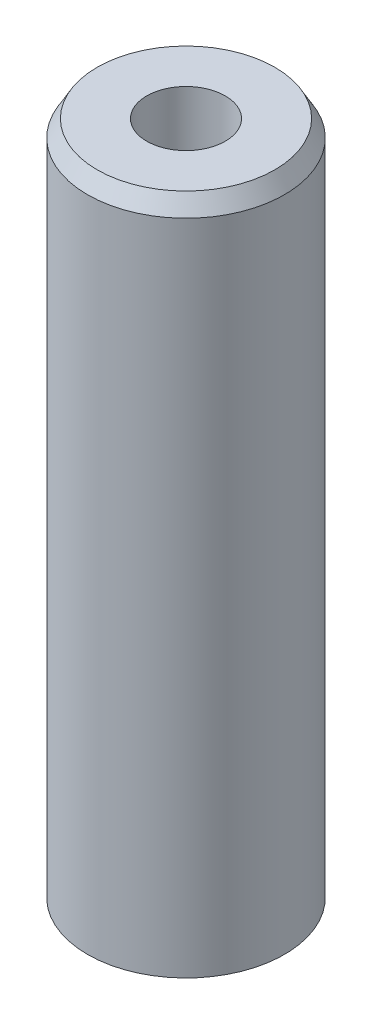
ISO-10303-21;
HEADER;
FILE_DESCRIPTION(('STEP AP214'),'2;1');
FILE_NAME('part.step','',(''),(''),'','','');
FILE_SCHEMA(('AUTOMOTIVE_DESIGN { 1 0 10303 214 1 1 1 1 }'));
ENDSEC;
DATA;
#1=APPLICATION_CONTEXT('core data for automotive mechanical design processes');
#2=APPLICATION_PROTOCOL_DEFINITION('international standard','automotive_design',2000,#1);
#3=PRODUCT_CONTEXT('',#1,'mechanical');
#4=PRODUCT('Part','Part','',(#3));
#5=PRODUCT_RELATED_PRODUCT_CATEGORY('part','',(#4));
#6=PRODUCT_DEFINITION_FORMATION('','',#4);
#7=PRODUCT_DEFINITION_CONTEXT('part definition',#1,'design');
#8=PRODUCT_DEFINITION('design','',#6,#7);
#9=PRODUCT_DEFINITION_SHAPE('','',#8);
#10=(LENGTH_UNIT() NAMED_UNIT(*) SI_UNIT(.MILLI.,.METRE.));
#11=(NAMED_UNIT(*) PLANE_ANGLE_UNIT() SI_UNIT($,.RADIAN.));
#12=(NAMED_UNIT(*) SI_UNIT($,.STERADIAN.) SOLID_ANGLE_UNIT());
#13=UNCERTAINTY_MEASURE_WITH_UNIT(LENGTH_MEASURE(1.E-05),#10,'distance_accuracy_value','');
#14=(GEOMETRIC_REPRESENTATION_CONTEXT(3) GLOBAL_UNCERTAINTY_ASSIGNED_CONTEXT((#13)) GLOBAL_UNIT_ASSIGNED_CONTEXT((#10,
#11,#12)) REPRESENTATION_CONTEXT('',''));
#15=CARTESIAN_POINT('',(0.,0.,0.));
#16=DIRECTION('',(0.,0.,1.));
#17=DIRECTION('',(1.,0.,0.));
#18=AXIS2_PLACEMENT_3D('',#15,#16,#17);
#19=CARTESIAN_POINT('',(0.,243.176926840896,0.));
#20=DIRECTION('',(0.,-1.,0.));
#21=DIRECTION('',(0.,0.,-1.));
#22=AXIS2_PLACEMENT_3D('',#19,#20,#21);
#23=CYLINDRICAL_SURFACE('',#22,35.);
#24=CARTESIAN_POINT('',(0.,237.235634188117,0.));
#25=DIRECTION('',(0.,1.,0.));
#26=DIRECTION('',(0.,0.,1.));
#27=AXIS2_PLACEMENT_3D('',#24,#25,#26);
#28=CIRCLE('',#27,35.);
#29=CARTESIAN_POINT('',(0.,237.235634188117,-35.));
#30=VERTEX_POINT('',#29);
#31=EDGE_CURVE('E50',#30,#30,#28,.F.);
#32=CARTESIAN_POINT('',(0.,3.430206912416,0.));
#33=DIRECTION('',(0.,1.,0.));
#34=DIRECTION('',(0.,0.,1.));
#35=AXIS2_PLACEMENT_3D('',#32,#33,#34);
#36=CIRCLE('',#35,35.);
#37=CARTESIAN_POINT('',(0.,3.430206912416,-35.));
#38=VERTEX_POINT('',#37);
#39=EDGE_CURVE('E51',#38,#38,#36,.T.);
#40=CARTESIAN_POINT('',(0.,237.235634188117,-35.));
#41=CARTESIAN_POINT('',(0.,234.800160987329,-35.));
#42=CARTESIAN_POINT('',(0.,232.36468778654,-35.));
#43=CARTESIAN_POINT('',(0.,227.493741384963,-35.));
#44=CARTESIAN_POINT('',(0.,225.058268184174,-35.));
#45=CARTESIAN_POINT('',(0.,220.187321782597,-35.));
#46=CARTESIAN_POINT('',(0.,217.751848581809,-35.));
#47=CARTESIAN_POINT('',(0.,212.880902180232,-35.));
#48=CARTESIAN_POINT('',(0.,210.445428979443,-35.));
#49=CARTESIAN_POINT('',(0.,205.574482577866,-35.));
#50=CARTESIAN_POINT('',(0.,203.139009377077,-35.));
#51=CARTESIAN_POINT('',(0.,198.2680629755,-35.));
#52=CARTESIAN_POINT('',(0.,195.832589774712,-35.));
#53=CARTESIAN_POINT('',(0.,190.961643373135,-35.));
#54=CARTESIAN_POINT('',(0.,188.526170172346,-35.));
#55=CARTESIAN_POINT('',(0.,183.655223770769,-35.));
#56=CARTESIAN_POINT('',(0.,181.219750569981,-35.));
#57=CARTESIAN_POINT('',(0.,176.348804168403,-35.));
#58=CARTESIAN_POINT('',(0.,173.913330967615,-35.));
#59=CARTESIAN_POINT('',(0.,169.042384566038,-35.));
#60=CARTESIAN_POINT('',(0.,166.606911365249,-35.));
#61=CARTESIAN_POINT('',(0.,161.735964963672,-35.));
#62=CARTESIAN_POINT('',(0.,159.300491762883,-35.));
#63=CARTESIAN_POINT('',(0.,154.429545361306,-35.));
#64=CARTESIAN_POINT('',(0.,151.994072160518,-35.));
#65=CARTESIAN_POINT('',(0.,147.123125758941,-35.));
#66=CARTESIAN_POINT('',(0.,144.687652558152,-35.));
#67=CARTESIAN_POINT('',(0.,139.816706156575,-35.));
#68=CARTESIAN_POINT('',(0.,137.381232955786,-35.));
#69=CARTESIAN_POINT('',(0.,132.510286554209,-35.));
#70=CARTESIAN_POINT('',(0.,130.074813353421,-35.));
#71=CARTESIAN_POINT('',(0.,125.203866951844,-35.));
#72=CARTESIAN_POINT('',(0.,122.768393751055,-35.));
#73=CARTESIAN_POINT('',(0.,117.897447349478,-35.));
#74=CARTESIAN_POINT('',(0.,115.46197414869,-35.));
#75=CARTESIAN_POINT('',(0.,110.591027747112,-35.));
#76=CARTESIAN_POINT('',(0.,108.155554546324,-35.));
#77=CARTESIAN_POINT('',(0.,103.284608144747,-35.));
#78=CARTESIAN_POINT('',(0.,100.849134943958,-35.));
#79=CARTESIAN_POINT('',(0.,95.9781885423811,-35.));
#80=CARTESIAN_POINT('',(0.,93.5427153415925,-35.));
#81=CARTESIAN_POINT('',(0.,88.6717689400154,-35.));
#82=CARTESIAN_POINT('',(0.,86.2362957392269,-35.));
#83=CARTESIAN_POINT('',(0.,81.3653493376498,-35.));
#84=CARTESIAN_POINT('',(0.,78.9298761368612,-35.));
#85=CARTESIAN_POINT('',(0.,74.0589297352841,-35.));
#86=CARTESIAN_POINT('',(0.,71.6234565344955,-35.));
#87=CARTESIAN_POINT('',(0.,66.7525101329184,-35.));
#88=CARTESIAN_POINT('',(0.,64.3170369321299,-35.));
#89=CARTESIAN_POINT('',(0.,59.4460905305528,-35.));
#90=CARTESIAN_POINT('',(0.,57.0106173297642,-35.));
#91=CARTESIAN_POINT('',(0.,52.1396709281871,-35.));
#92=CARTESIAN_POINT('',(0.,49.7041977273985,-35.));
#93=CARTESIAN_POINT('',(0.,44.8332513258214,-35.));
#94=CARTESIAN_POINT('',(0.,42.3977781250329,-35.));
#95=CARTESIAN_POINT('',(0.,37.5268317234558,-35.));
#96=CARTESIAN_POINT('',(0.,35.0913585226672,-35.));
#97=CARTESIAN_POINT('',(0.,30.2204121210901,-35.));
#98=CARTESIAN_POINT('',(0.,27.7849389203015,-35.));
#99=CARTESIAN_POINT('',(0.,22.9139925187244,-35.));
#100=CARTESIAN_POINT('',(0.,20.4785193179359,-35.));
#101=CARTESIAN_POINT('',(0.,15.6075729163588,-35.));
#102=CARTESIAN_POINT('',(0.,13.1720997155702,-35.));
#103=CARTESIAN_POINT('',(0.,8.3011533139931,-35.));
#104=CARTESIAN_POINT('',(0.,5.86568011320455,-35.));
#105=CARTESIAN_POINT('',(0.,3.430206912416,-35.));
#106=B_SPLINE_CURVE_WITH_KNOTS('',3,(#40,#41,#42,#43,#44,#45,#46,#47,#48,#49,#50,#51,#52,#53,
#54,#55,#56,#57,#58,#59,#60,#61,#62,#63,#64,#65,#66,#67,#68,#69,#70,#71,#72,#73,#74,#75,#76,#77,
#78,#79,#80,#81,#82,#83,#84,#85,#86,#87,#88,#89,#90,#91,#92,#93,#94,#95,#96,#97,#98,#99,#100,
#101,#102,#103,#104,#105),.UNSPECIFIED.,.F.,.F.,(4,2,2,2,2,2,2,2,2,2,2,2,2,2,2,2,2,2,2,2,2,2,2,
2,2,2,2,2,2,2,2,2,4),(0.,7.30641960236564,14.6128392047313,21.919258807097,29.2256784094626,
36.5320980118283,43.838517614194,51.1449372165596,58.4513568189253,65.757776421291,
73.0641960236566,80.3706156260223,87.677035228388,94.9834548307536,102.289874433119,
109.596294035485,116.902713637851,124.209133240216,131.515552842582,138.821972444948,
146.128392047313,153.434811649679,160.741231252045,168.04765085441,175.354070456776,
182.660490059142,189.966909661507,197.273329263873,204.579748866239,211.886168468604,
219.19258807097,226.499007673336,233.805427275701),.UNSPECIFIED.);
#107=EDGE_CURVE('BSEAM39',#30,#38,#106,.T.);
#108=ORIENTED_EDGE('',*,*,#31,.T.);
#109=ORIENTED_EDGE('',*,*,#39,.T.);
#110=ORIENTED_EDGE('',*,*,#107,.T.);
#111=ORIENTED_EDGE('',*,*,#107,.F.);
#112=EDGE_LOOP('',(#108,#110,#109,#111));
#113=FACE_BOUND('',#112,.T.);
#114=ADVANCED_FACE('F39',(#113),#23,.T.);
#115=CARTESIAN_POINT('',(0.,243.176926840896,0.));
#116=DIRECTION('',(0.,1.,0.));
#117=DIRECTION('',(0.,0.,1.));
#118=AXIS2_PLACEMENT_3D('',#115,#116,#117);
#119=PLANE('',#118);
#120=CARTESIAN_POINT('',(0.,243.176926840896,0.));
#121=DIRECTION('',(0.,1.,0.));
#122=DIRECTION('',(0.,0.,1.));
#123=AXIS2_PLACEMENT_3D('',#120,#121,#122);
#124=CIRCLE('',#123,31.5697930875842);
#125=CARTESIAN_POINT('',(0.,243.176926840896,31.5697930875842));
#126=VERTEX_POINT('',#125);
#127=EDGE_CURVE('E54',#126,#126,#124,.T.);
#128=ORIENTED_EDGE('',*,*,#127,.T.);
#129=EDGE_LOOP('',(#128));
#130=FACE_BOUND('',#129,.T.);
#131=CARTESIAN_POINT('',(0.,243.176926840896,0.));
#132=DIRECTION('',(0.,1.,0.));
#133=DIRECTION('',(0.,0.,1.));
#134=AXIS2_PLACEMENT_3D('',#131,#132,#133);
#135=CIRCLE('',#134,13.9652639338835);
#136=CARTESIAN_POINT('',(0.,243.176926840896,-13.9652639338835));
#137=VERTEX_POINT('',#136);
#138=EDGE_CURVE('E58',#137,#137,#135,.T.);
#139=ORIENTED_EDGE('',*,*,#138,.F.);
#140=EDGE_LOOP('',(#139));
#141=FACE_BOUND('',#140,.T.);
#142=ADVANCED_FACE('F69',(#130,#141),#119,.T.);
#143=CARTESIAN_POINT('',(0.,0.,0.));
#144=DIRECTION('',(0.,1.,0.));
#145=DIRECTION('',(0.,0.,1.));
#146=AXIS2_PLACEMENT_3D('',#143,#144,#145);
#147=PLANE('',#146);
#148=CARTESIAN_POINT('',(0.,0.,0.));
#149=DIRECTION('',(0.,1.,0.));
#150=DIRECTION('',(0.,0.,1.));
#151=AXIS2_PLACEMENT_3D('',#148,#149,#150);
#152=CIRCLE('',#151,29.0587073472215);
#153=CARTESIAN_POINT('',(0.,0.,29.0587073472215));
#154=VERTEX_POINT('',#153);
#155=EDGE_CURVE('E10',#154,#154,#152,.F.);
#156=ORIENTED_EDGE('',*,*,#155,.T.);
#157=EDGE_LOOP('',(#156));
#158=FACE_BOUND('',#157,.T.);
#159=CARTESIAN_POINT('',(0.,0.,0.));
#160=DIRECTION('',(0.,1.,0.));
#161=DIRECTION('',(0.,0.,1.));
#162=AXIS2_PLACEMENT_3D('',#159,#160,#161);
#163=CIRCLE('',#162,13.9652639338835);
#164=CARTESIAN_POINT('',(0.,0.,-13.9652639338835));
#165=VERTEX_POINT('',#164);
#166=EDGE_CURVE('E63',#165,#165,#163,.T.);
#167=ORIENTED_EDGE('',*,*,#166,.T.);
#168=EDGE_LOOP('',(#167));
#169=FACE_BOUND('',#168,.T.);
#170=ADVANCED_FACE('F75',(#158,#169),#147,.F.);
#171=CARTESIAN_POINT('',(0.,243.176926840896,0.));
#172=DIRECTION('',(0.,-1.,0.));
#173=DIRECTION('',(0.,0.,-1.));
#174=AXIS2_PLACEMENT_3D('',#171,#172,#173);
#175=CYLINDRICAL_SURFACE('',#174,13.9652639338835);
#176=CARTESIAN_POINT('',(0.,243.176926840896,-13.9652639338835));
#177=CARTESIAN_POINT('',(0.,240.64383385297,-13.9652639338835));
#178=CARTESIAN_POINT('',(0.,238.110740865044,-13.9652639338835));
#179=CARTESIAN_POINT('',(0.,233.044554889192,-13.9652639338835));
#180=CARTESIAN_POINT('',(0.,230.511461901266,-13.9652639338835));
#181=CARTESIAN_POINT('',(0.,225.445275925414,-13.9652639338835));
#182=CARTESIAN_POINT('',(0.,222.912182937488,-13.9652639338835));
#183=CARTESIAN_POINT('',(0.,217.845996961636,-13.9652639338835));
#184=CARTESIAN_POINT('',(0.,215.31290397371,-13.9652639338835));
#185=CARTESIAN_POINT('',(0.,210.246717997858,-13.9652639338835));
#186=CARTESIAN_POINT('',(0.,207.713625009932,-13.9652639338835));
#187=CARTESIAN_POINT('',(0.,202.64743903408,-13.9652639338835));
#188=CARTESIAN_POINT('',(0.,200.114346046154,-13.9652639338835));
#189=CARTESIAN_POINT('',(0.,195.048160070302,-13.9652639338835));
#190=CARTESIAN_POINT('',(0.,192.515067082376,-13.9652639338835));
#191=CARTESIAN_POINT('',(0.,187.448881106524,-13.9652639338835));
#192=CARTESIAN_POINT('',(0.,184.915788118598,-13.9652639338835));
#193=CARTESIAN_POINT('',(0.,179.849602142746,-13.9652639338835));
#194=CARTESIAN_POINT('',(0.,177.31650915482,-13.9652639338835));
#195=CARTESIAN_POINT('',(0.,172.250323178968,-13.9652639338835));
#196=CARTESIAN_POINT('',(0.,169.717230191042,-13.9652639338835));
#197=CARTESIAN_POINT('',(0.,164.65104421519,-13.9652639338835));
#198=CARTESIAN_POINT('',(0.,162.117951227264,-13.9652639338835));
#199=CARTESIAN_POINT('',(0.,157.051765251412,-13.9652639338835));
#200=CARTESIAN_POINT('',(0.,154.518672263486,-13.9652639338835));
#201=CARTESIAN_POINT('',(0.,149.452486287634,-13.9652639338835));
#202=CARTESIAN_POINT('',(0.,146.919393299708,-13.9652639338835));
#203=CARTESIAN_POINT('',(0.,141.853207323856,-13.9652639338835));
#204=CARTESIAN_POINT('',(0.,139.32011433593,-13.9652639338835));
#205=CARTESIAN_POINT('',(0.,134.253928360078,-13.9652639338835));
#206=CARTESIAN_POINT('',(0.,131.720835372152,-13.9652639338835));
#207=CARTESIAN_POINT('',(0.,126.6546493963,-13.9652639338835));
#208=CARTESIAN_POINT('',(0.,124.121556408374,-13.9652639338835));
#209=CARTESIAN_POINT('',(0.,119.055370432522,-13.9652639338835));
#210=CARTESIAN_POINT('',(0.,116.522277444596,-13.9652639338835));
#211=CARTESIAN_POINT('',(0.,111.456091468744,-13.9652639338835));
#212=CARTESIAN_POINT('',(0.,108.922998480818,-13.9652639338835));
#213=CARTESIAN_POINT('',(0.,103.856812504966,-13.9652639338835));
#214=CARTESIAN_POINT('',(0.,101.32371951704,-13.9652639338835));
#215=CARTESIAN_POINT('',(0.,96.2575335411878,-13.9652639338835));
#216=CARTESIAN_POINT('',(0.,93.7244405532618,-13.9652639338835));
#217=CARTESIAN_POINT('',(0.,88.6582545774098,-13.9652639338835));
#218=CARTESIAN_POINT('',(0.,86.1251615894838,-13.9652639338835));
#219=CARTESIAN_POINT('',(0.,81.0589756136318,-13.9652639338835));
#220=CARTESIAN_POINT('',(0.,78.5258826257058,-13.9652639338835));
#221=CARTESIAN_POINT('',(0.,73.4596966498538,-13.9652639338835));
#222=CARTESIAN_POINT('',(0.,70.9266036619278,-13.9652639338835));
#223=CARTESIAN_POINT('',(0.,65.8604176860758,-13.9652639338835));
#224=CARTESIAN_POINT('',(0.,63.3273246981498,-13.9652639338835));
#225=CARTESIAN_POINT('',(0.,58.2611387222979,-13.9652639338835));
#226=CARTESIAN_POINT('',(0.,55.7280457343719,-13.9652639338835));
#227=CARTESIAN_POINT('',(0.,50.6618597585199,-13.9652639338835));
#228=CARTESIAN_POINT('',(0.,48.1287667705939,-13.9652639338835));
#229=CARTESIAN_POINT('',(0.,43.0625807947419,-13.9652639338835));
#230=CARTESIAN_POINT('',(0.,40.5294878068159,-13.9652639338835));
#231=CARTESIAN_POINT('',(0.,35.4633018309639,-13.9652639338835));
#232=CARTESIAN_POINT('',(0.,32.9302088430379,-13.9652639338835));
#233=CARTESIAN_POINT('',(0.,27.8640228671859,-13.9652639338835));
#234=CARTESIAN_POINT('',(0.,25.3309298792599,-13.9652639338835));
#235=CARTESIAN_POINT('',(0.,20.2647439034079,-13.9652639338835));
#236=CARTESIAN_POINT('',(0.,17.7316509154819,-13.9652639338835));
#237=CARTESIAN_POINT('',(0.,12.66546493963,-13.9652639338835));
#238=CARTESIAN_POINT('',(0.,10.132371951704,-13.9652639338835));
#239=CARTESIAN_POINT('',(0.,5.06618597585196,-13.9652639338835));
#240=CARTESIAN_POINT('',(0.,2.53309298792597,-13.9652639338835));
#241=CARTESIAN_POINT('',(0.,0.,-13.9652639338835));
#242=B_SPLINE_CURVE_WITH_KNOTS('',3,(#176,#177,#178,#179,#180,#181,#182,#183,#184,#185,#186,
#187,#188,#189,#190,#191,#192,#193,#194,#195,#196,#197,#198,#199,#200,#201,#202,#203,#204,#205,
#206,#207,#208,#209,#210,#211,#212,#213,#214,#215,#216,#217,#218,#219,#220,#221,#222,#223,#224,
#225,#226,#227,#228,#229,#230,#231,#232,#233,#234,#235,#236,#237,#238,#239,#240,#241),
.UNSPECIFIED.,.F.,.F.,(4,2,2,2,2,2,2,2,2,2,2,2,2,2,2,2,2,2,2,2,2,2,2,2,2,2,2,2,2,2,2,2,4),(0.,
7.59927896377796,15.1985579275559,22.7978368913339,30.3971158551119,37.9963948188899,
45.5956737826679,53.1949527464459,60.7942317102239,68.3935106740018,75.9927896377798,
83.5920686015578,91.1913475653358,98.7906265291138,106.389905492892,113.98918445667,
121.588463420448,129.187742384226,136.787021348004,144.386300311782,151.98557927556,
159.584858239338,167.184137203116,174.783416166894,182.382695130672,189.98197409445,
197.581253058228,205.180532022006,212.779810985784,220.379089949562,227.97836891334,
235.577647877118,243.176926840896),.UNSPECIFIED.);
#243=EDGE_CURVE('BSEAM70',#137,#165,#242,.T.);
#244=ORIENTED_EDGE('',*,*,#138,.T.);
#245=ORIENTED_EDGE('',*,*,#166,.F.);
#246=ORIENTED_EDGE('',*,*,#243,.T.);
#247=ORIENTED_EDGE('',*,*,#243,.F.);
#248=EDGE_LOOP('',(#244,#246,#245,#247));
#249=FACE_BOUND('',#248,.T.);
#250=ADVANCED_FACE('F70',(#249),#175,.F.);
#251=CARTESIAN_POINT('',(0.,243.176926840896,0.));
#252=DIRECTION('',(0.,-1.,0.));
#253=DIRECTION('',(0.,0.,-1.));
#254=AXIS2_PLACEMENT_3D('',#251,#252,#253);
#255=CONICAL_SURFACE('',#254,31.5697930875842,0.523598775598295);
#256=ORIENTED_EDGE('',*,*,#31,.F.);
#257=EDGE_LOOP('',(#256));
#258=FACE_BOUND('',#257,.T.);
#259=ORIENTED_EDGE('',*,*,#127,.F.);
#260=EDGE_LOOP('',(#259));
#261=FACE_BOUND('',#260,.T.);
#262=ADVANCED_FACE('F81',(#258,#261),#255,.T.);
#263=CARTESIAN_POINT('',(0.,3.430206912416,0.));
#264=DIRECTION('',(0.,1.,0.));
#265=DIRECTION('',(0.,0.,1.));
#266=AXIS2_PLACEMENT_3D('',#263,#264,#265);
#267=CONICAL_SURFACE('',#266,35.,1.0471975511966);
#268=ORIENTED_EDGE('',*,*,#155,.F.);
#269=EDGE_LOOP('',(#268));
#270=FACE_BOUND('',#269,.T.);
#271=ORIENTED_EDGE('',*,*,#39,.F.);
#272=EDGE_LOOP('',(#271));
#273=FACE_BOUND('',#272,.T.);
#274=ADVANCED_FACE('F45',(#270,#273),#267,.T.);
#275=CLOSED_SHELL('',(#114,#142,#170,#250,#262,#274));
#276=MANIFOLD_SOLID_BREP('B2',#275);
#277=ADVANCED_BREP_SHAPE_REPRESENTATION('',(#18,#276),#14);
#278=SHAPE_DEFINITION_REPRESENTATION(#9,#277);
ENDSEC;
END-ISO-10303-21;
